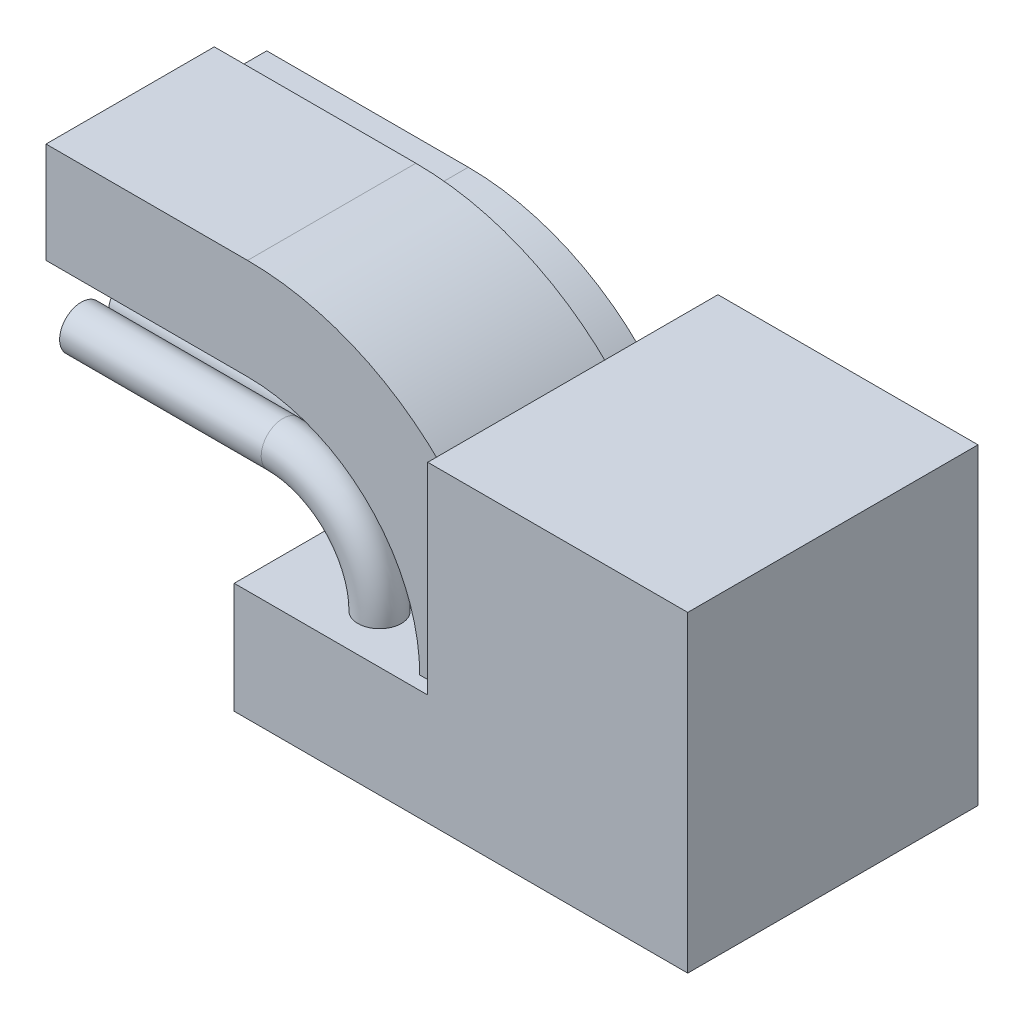
ISO-10303-21;
HEADER;
FILE_DESCRIPTION(('STEP AP214'),'2;1');
FILE_NAME('part.step','',(''),(''),'','','');
FILE_SCHEMA(('AUTOMOTIVE_DESIGN { 1 0 10303 214 1 1 1 1 }'));
ENDSEC;
DATA;
#1=APPLICATION_CONTEXT('core data for automotive mechanical design processes');
#2=APPLICATION_PROTOCOL_DEFINITION('international standard','automotive_design',2000,#1);
#3=PRODUCT_CONTEXT('',#1,'mechanical');
#4=PRODUCT('Part','Part','',(#3));
#5=PRODUCT_RELATED_PRODUCT_CATEGORY('part','',(#4));
#6=PRODUCT_DEFINITION_FORMATION('','',#4);
#7=PRODUCT_DEFINITION_CONTEXT('part definition',#1,'design');
#8=PRODUCT_DEFINITION('design','',#6,#7);
#9=PRODUCT_DEFINITION_SHAPE('','',#8);
#10=(LENGTH_UNIT() NAMED_UNIT(*) SI_UNIT(.MILLI.,.METRE.));
#11=(NAMED_UNIT(*) PLANE_ANGLE_UNIT() SI_UNIT($,.RADIAN.));
#12=(NAMED_UNIT(*) SI_UNIT($,.STERADIAN.) SOLID_ANGLE_UNIT());
#13=UNCERTAINTY_MEASURE_WITH_UNIT(LENGTH_MEASURE(1.E-05),#10,'distance_accuracy_value','');
#14=(GEOMETRIC_REPRESENTATION_CONTEXT(3) GLOBAL_UNCERTAINTY_ASSIGNED_CONTEXT((#13)) GLOBAL_UNIT_ASSIGNED_CONTEXT((#10,
#11,#12)) REPRESENTATION_CONTEXT('',''));
#15=CARTESIAN_POINT('',(0.,0.,0.));
#16=DIRECTION('',(0.,0.,1.));
#17=DIRECTION('',(1.,0.,0.));
#18=AXIS2_PLACEMENT_3D('',#15,#16,#17);
#19=CARTESIAN_POINT('',(0.,13.97,0.));
#20=DIRECTION('',(0.,-1.,0.));
#21=DIRECTION('',(0.,0.,-1.));
#22=AXIS2_PLACEMENT_3D('',#19,#20,#21);
#23=PLANE('',#22);
#24=CARTESIAN_POINT('',(-16.383,13.97,12.1570138463607));
#25=DIRECTION('',(0.,-1.,0.));
#26=DIRECTION('',(0.,0.,-1.));
#27=AXIS2_PLACEMENT_3D('',#24,#25,#26);
#28=CIRCLE('',#27,2.7305);
#29=CARTESIAN_POINT('',(-13.6525,13.97,12.1570138463607));
#30=VERTEX_POINT('',#29);
#31=EDGE_CURVE('E265',#30,#30,#28,.F.);
#32=ORIENTED_EDGE('',*,*,#31,.F.);
#33=EDGE_LOOP('',(#32));
#34=FACE_BOUND('',#33,.T.);
#35=CARTESIAN_POINT('',(-16.383,13.97,0.));
#36=DIRECTION('',(0.,-1.,0.));
#37=DIRECTION('',(0.,0.,-1.));
#38=AXIS2_PLACEMENT_3D('',#35,#36,#37);
#39=CIRCLE('',#38,2.7305);
#40=CARTESIAN_POINT('',(-13.6525,13.97,0.));
#41=VERTEX_POINT('',#40);
#42=EDGE_CURVE('E341',#41,#41,#39,.F.);
#43=ORIENTED_EDGE('',*,*,#42,.F.);
#44=EDGE_LOOP('',(#43));
#45=FACE_BOUND('',#44,.T.);
#46=CARTESIAN_POINT('',(-16.383,13.97,5.99911457720026));
#47=DIRECTION('',(0.,-1.,0.));
#48=DIRECTION('',(0.,0.,-1.));
#49=AXIS2_PLACEMENT_3D('',#46,#47,#48);
#50=CIRCLE('',#49,2.7305);
#51=CARTESIAN_POINT('',(-13.6525,13.97,5.99911457720026));
#52=VERTEX_POINT('',#51);
#53=EDGE_CURVE('E343',#52,#52,#50,.F.);
#54=ORIENTED_EDGE('',*,*,#53,.F.);
#55=EDGE_LOOP('',(#54));
#56=FACE_BOUND('',#55,.T.);
#57=DIRECTION('',(-1.,0.,0.));
#58=VECTOR('',#57,1.);
#59=CARTESIAN_POINT('',(-0.965296126701103,13.97,-4.60538542279974));
#60=LINE('',#59,#58);
#61=CARTESIAN_POINT('',(-4.19100000000001,13.97,-4.60538542279974));
#62=VERTEX_POINT('',#61);
#63=CARTESIAN_POINT('',(-6.880808194893,13.97,-4.60538542279974));
#64=VERTEX_POINT('',#63);
#65=EDGE_CURVE('E190',#62,#64,#60,.T.);
#66=ORIENTED_EDGE('',*,*,#65,.F.);
#67=DIRECTION('',(0.,0.,1.));
#68=VECTOR('',#67,1.);
#69=CARTESIAN_POINT('',(-4.19100000000001,13.97,-18.288));
#70=LINE('',#69,#68);
#71=CARTESIAN_POINT('',(-4.19100000000001,13.97,-18.288));
#72=VERTEX_POINT('',#71);
#73=EDGE_CURVE('E246',#72,#62,#70,.T.);
#74=ORIENTED_EDGE('',*,*,#73,.F.);
#75=DIRECTION('',(-1.,0.,0.));
#76=VECTOR('',#75,1.);
#77=CARTESIAN_POINT('',(-28.575,13.97,-18.288));
#78=LINE('',#77,#76);
#79=CARTESIAN_POINT('',(-28.575,13.97,-18.288));
#80=VERTEX_POINT('',#79);
#81=EDGE_CURVE('E411',#72,#80,#78,.T.);
#82=ORIENTED_EDGE('',*,*,#81,.T.);
#83=DIRECTION('',(0.,0.,1.));
#84=VECTOR('',#83,1.);
#85=CARTESIAN_POINT('',(-28.575,13.97,18.288));
#86=LINE('',#85,#84);
#87=CARTESIAN_POINT('',(-28.575,13.97,18.288));
#88=VERTEX_POINT('',#87);
#89=EDGE_CURVE('E324',#80,#88,#86,.T.);
#90=ORIENTED_EDGE('',*,*,#89,.T.);
#91=DIRECTION('',(1.,0.,0.));
#92=VECTOR('',#91,1.);
#93=CARTESIAN_POINT('',(-28.575,13.97,18.288));
#94=LINE('',#93,#92);
#95=CARTESIAN_POINT('',(-4.19100000000001,13.97,18.288));
#96=VERTEX_POINT('',#95);
#97=EDGE_CURVE('E321',#88,#96,#94,.T.);
#98=ORIENTED_EDGE('',*,*,#97,.T.);
#99=CARTESIAN_POINT('',(-4.19100000000001,13.97,16.6036145772003));
#100=VERTEX_POINT('',#99);
#101=EDGE_CURVE('E241',#100,#96,#70,.T.);
#102=ORIENTED_EDGE('',*,*,#101,.F.);
#103=DIRECTION('',(1.,0.,0.));
#104=VECTOR('',#103,1.);
#105=CARTESIAN_POINT('',(5.81919180510699,13.97,16.6036145772003));
#106=LINE('',#105,#104);
#107=CARTESIAN_POINT('',(-6.880808194893,13.97,16.6036145772003));
#108=VERTEX_POINT('',#107);
#109=EDGE_CURVE('E53',#108,#100,#106,.T.);
#110=ORIENTED_EDGE('',*,*,#109,.F.);
#111=DIRECTION('',(0.,0.,1.));
#112=VECTOR('',#111,1.);
#113=CARTESIAN_POINT('',(-6.88080819489301,13.97,16.6036145772003));
#114=LINE('',#113,#112);
#115=EDGE_CURVE('E48',#64,#108,#114,.T.);
#116=ORIENTED_EDGE('',*,*,#115,.F.);
#117=EDGE_LOOP('',(#66,#74,#82,#90,#98,#102,#110,#116));
#118=FACE_BOUND('',#117,.T.);
#119=ADVANCED_FACE('F33',(#34,#45,#56,#118),#23,.F.);
#120=CARTESIAN_POINT('',(-4.19100000000001,39.37,-18.288));
#121=DIRECTION('',(1.,0.,0.));
#122=DIRECTION('',(0.,0.,-1.));
#123=AXIS2_PLACEMENT_3D('',#120,#121,#122);
#124=PLANE('',#123);
#125=DIRECTION('',(0.,-1.,0.));
#126=VECTOR('',#125,1.);
#127=CARTESIAN_POINT('',(-4.19100000000001,39.37,-4.60538542279974));
#128=LINE('',#127,#126);
#129=CARTESIAN_POINT('',(-4.19100000000001,26.9205324975947,-4.60538542279974));
#130=VERTEX_POINT('',#129);
#131=EDGE_CURVE('E11',#130,#62,#128,.T.);
#132=ORIENTED_EDGE('',*,*,#131,.F.);
#133=DIRECTION('',(0.,0.,-1.));
#134=VECTOR('',#133,1.);
#135=CARTESIAN_POINT('',(-4.19100000000001,26.9205324975947,18.288));
#136=LINE('',#135,#134);
#137=CARTESIAN_POINT('',(-4.19100000000001,26.9205324975947,-11.2093854227997));
#138=VERTEX_POINT('',#137);
#139=EDGE_CURVE('E41',#138,#130,#136,.F.);
#140=ORIENTED_EDGE('',*,*,#139,.F.);
#141=DIRECTION('',(0.,-1.,0.));
#142=VECTOR('',#141,1.);
#143=CARTESIAN_POINT('',(-4.19100000000001,39.37,-11.2093854227997));
#144=LINE('',#143,#142);
#145=CARTESIAN_POINT('',(-4.19100000000001,32.5526626397534,-11.2093854227997));
#146=VERTEX_POINT('',#145);
#147=EDGE_CURVE('E279',#146,#138,#144,.T.);
#148=ORIENTED_EDGE('',*,*,#147,.F.);
#149=DIRECTION('',(0.,0.,-1.));
#150=VECTOR('',#149,1.);
#151=CARTESIAN_POINT('',(-4.19100000000001,32.5526626397534,18.288));
#152=LINE('',#151,#150);
#153=CARTESIAN_POINT('',(-4.19100000000001,32.5526626397534,-4.60538542279974));
#154=VERTEX_POINT('',#153);
#155=EDGE_CURVE('E276',#154,#146,#152,.T.);
#156=ORIENTED_EDGE('',*,*,#155,.F.);
#157=DIRECTION('',(0.,-1.,0.));
#158=VECTOR('',#157,1.);
#159=CARTESIAN_POINT('',(-4.19100000000001,39.37,-4.60538542279974));
#160=LINE('',#159,#158);
#161=CARTESIAN_POINT('',(-4.19100000000001,38.2265655839092,-4.60538542279974));
#162=VERTEX_POINT('',#161);
#163=EDGE_CURVE('E273',#162,#154,#160,.T.);
#164=ORIENTED_EDGE('',*,*,#163,.F.);
#165=DIRECTION('',(0.,0.,-1.));
#166=VECTOR('',#165,1.);
#167=CARTESIAN_POINT('',(-4.19100000000001,38.2265655839092,18.288));
#168=LINE('',#167,#166);
#169=CARTESIAN_POINT('',(-4.19100000000001,38.2265655839092,16.6036145772003));
#170=VERTEX_POINT('',#169);
#171=EDGE_CURVE('E270',#170,#162,#168,.T.);
#172=ORIENTED_EDGE('',*,*,#171,.F.);
#173=DIRECTION('',(0.,1.,0.));
#174=VECTOR('',#173,1.);
#175=CARTESIAN_POINT('',(-4.19100000000001,39.37,16.6036145772003));
#176=LINE('',#175,#174);
#177=EDGE_CURVE('E267',#100,#170,#176,.T.);
#178=ORIENTED_EDGE('',*,*,#177,.F.);
#179=ORIENTED_EDGE('',*,*,#101,.T.);
#180=DIRECTION('',(0.,-1.,0.));
#181=VECTOR('',#180,1.);
#182=CARTESIAN_POINT('',(-4.19100000000001,39.37,18.288));
#183=LINE('',#182,#181);
#184=CARTESIAN_POINT('',(-4.19100000000001,39.37,18.288));
#185=VERTEX_POINT('',#184);
#186=EDGE_CURVE('E253',#185,#96,#183,.T.);
#187=ORIENTED_EDGE('',*,*,#186,.F.);
#188=DIRECTION('',(0.,0.,1.));
#189=VECTOR('',#188,1.);
#190=CARTESIAN_POINT('',(-4.19100000000001,39.37,-18.288));
#191=LINE('',#190,#189);
#192=CARTESIAN_POINT('',(-4.19100000000001,39.37,-18.288));
#193=VERTEX_POINT('',#192);
#194=EDGE_CURVE('E248',#193,#185,#191,.T.);
#195=ORIENTED_EDGE('',*,*,#194,.F.);
#196=DIRECTION('',(0.,-1.,0.));
#197=VECTOR('',#196,1.);
#198=CARTESIAN_POINT('',(-4.19100000000001,39.37,-18.288));
#199=LINE('',#198,#197);
#200=EDGE_CURVE('E332',#193,#72,#199,.T.);
#201=ORIENTED_EDGE('',*,*,#200,.T.);
#202=ORIENTED_EDGE('',*,*,#73,.T.);
#203=EDGE_LOOP('',(#132,#140,#148,#156,#164,#172,#178,#179,#187,#195,#201,#202));
#204=FACE_BOUND('',#203,.T.);
#205=ADVANCED_FACE('F317',(#204),#124,.F.);
#206=CARTESIAN_POINT('',(28.575,13.97,18.288));
#207=DIRECTION('',(-1.,0.,0.));
#208=DIRECTION('',(0.,0.,1.));
#209=AXIS2_PLACEMENT_3D('',#206,#207,#208);
#210=PLANE('',#209);
#211=DIRECTION('',(0.,0.,-1.));
#212=VECTOR('',#211,1.);
#213=CARTESIAN_POINT('',(28.575,0.,18.288));
#214=LINE('',#213,#212);
#215=CARTESIAN_POINT('',(28.575,0.,18.288));
#216=VERTEX_POINT('',#215);
#217=CARTESIAN_POINT('',(28.575,0.,-18.288));
#218=VERTEX_POINT('',#217);
#219=EDGE_CURVE('E334',#216,#218,#214,.T.);
#220=ORIENTED_EDGE('',*,*,#219,.T.);
#221=DIRECTION('',(0.,-1.,0.));
#222=VECTOR('',#221,1.);
#223=CARTESIAN_POINT('',(28.575,13.97,-18.288));
#224=LINE('',#223,#222);
#225=CARTESIAN_POINT('',(28.575,39.37,-18.288));
#226=VERTEX_POINT('',#225);
#227=EDGE_CURVE('E344',#226,#218,#224,.T.);
#228=ORIENTED_EDGE('',*,*,#227,.F.);
#229=DIRECTION('',(0.,0.,-1.));
#230=VECTOR('',#229,1.);
#231=CARTESIAN_POINT('',(28.575,39.37,-18.288));
#232=LINE('',#231,#230);
#233=CARTESIAN_POINT('',(28.575,39.37,18.288));
#234=VERTEX_POINT('',#233);
#235=EDGE_CURVE('E242',#234,#226,#232,.T.);
#236=ORIENTED_EDGE('',*,*,#235,.F.);
#237=DIRECTION('',(0.,-1.,0.));
#238=VECTOR('',#237,1.);
#239=CARTESIAN_POINT('',(28.575,13.97,18.288));
#240=LINE('',#239,#238);
#241=EDGE_CURVE('E328',#234,#216,#240,.T.);
#242=ORIENTED_EDGE('',*,*,#241,.T.);
#243=EDGE_LOOP('',(#220,#228,#236,#242));
#244=FACE_BOUND('',#243,.T.);
#245=ADVANCED_FACE('F35',(#244),#210,.F.);
#246=CARTESIAN_POINT('',(-28.575,13.97,-18.288));
#247=DIRECTION('',(0.,0.,1.));
#248=DIRECTION('',(1.,0.,0.));
#249=AXIS2_PLACEMENT_3D('',#246,#247,#248);
#250=PLANE('',#249);
#251=DIRECTION('',(-1.,0.,0.));
#252=VECTOR('',#251,1.);
#253=CARTESIAN_POINT('',(-28.575,0.,-18.288));
#254=LINE('',#253,#252);
#255=CARTESIAN_POINT('',(-28.575,0.,-18.288));
#256=VERTEX_POINT('',#255);
#257=EDGE_CURVE('E396',#218,#256,#254,.T.);
#258=ORIENTED_EDGE('',*,*,#257,.T.);
#259=DIRECTION('',(0.,-1.,0.));
#260=VECTOR('',#259,1.);
#261=CARTESIAN_POINT('',(-28.575,13.97,-18.288));
#262=LINE('',#261,#260);
#263=EDGE_CURVE('E399',#80,#256,#262,.T.);
#264=ORIENTED_EDGE('',*,*,#263,.F.);
#265=ORIENTED_EDGE('',*,*,#81,.F.);
#266=ORIENTED_EDGE('',*,*,#200,.F.);
#267=DIRECTION('',(-1.,0.,0.));
#268=VECTOR('',#267,1.);
#269=CARTESIAN_POINT('',(28.575,39.37,-18.288));
#270=LINE('',#269,#268);
#271=EDGE_CURVE('E245',#226,#193,#270,.T.);
#272=ORIENTED_EDGE('',*,*,#271,.F.);
#273=ORIENTED_EDGE('',*,*,#227,.T.);
#274=EDGE_LOOP('',(#258,#264,#265,#266,#272,#273));
#275=FACE_BOUND('',#274,.T.);
#276=ADVANCED_FACE('F386',(#275),#250,.F.);
#277=CARTESIAN_POINT('',(-28.575,13.97,18.288));
#278=DIRECTION('',(1.,0.,0.));
#279=DIRECTION('',(0.,0.,-1.));
#280=AXIS2_PLACEMENT_3D('',#277,#278,#279);
#281=PLANE('',#280);
#282=DIRECTION('',(0.,0.,1.));
#283=VECTOR('',#282,1.);
#284=CARTESIAN_POINT('',(-28.575,0.,18.288));
#285=LINE('',#284,#283);
#286=CARTESIAN_POINT('',(-28.575,0.,18.288));
#287=VERTEX_POINT('',#286);
#288=EDGE_CURVE('E404',#256,#287,#285,.T.);
#289=ORIENTED_EDGE('',*,*,#288,.T.);
#290=DIRECTION('',(0.,-1.,0.));
#291=VECTOR('',#290,1.);
#292=CARTESIAN_POINT('',(-28.575,13.97,18.288));
#293=LINE('',#292,#291);
#294=EDGE_CURVE('E406',#88,#287,#293,.T.);
#295=ORIENTED_EDGE('',*,*,#294,.F.);
#296=ORIENTED_EDGE('',*,*,#89,.F.);
#297=ORIENTED_EDGE('',*,*,#263,.T.);
#298=EDGE_LOOP('',(#289,#295,#296,#297));
#299=FACE_BOUND('',#298,.T.);
#300=ADVANCED_FACE('F384',(#299),#281,.F.);
#301=CARTESIAN_POINT('',(-28.575,13.97,18.288));
#302=DIRECTION('',(0.,0.,-1.));
#303=DIRECTION('',(-1.,0.,0.));
#304=AXIS2_PLACEMENT_3D('',#301,#302,#303);
#305=PLANE('',#304);
#306=DIRECTION('',(1.,0.,0.));
#307=VECTOR('',#306,1.);
#308=CARTESIAN_POINT('',(-28.575,0.,18.288));
#309=LINE('',#308,#307);
#310=EDGE_CURVE('E409',#287,#216,#309,.T.);
#311=ORIENTED_EDGE('',*,*,#310,.T.);
#312=ORIENTED_EDGE('',*,*,#241,.F.);
#313=DIRECTION('',(1.,0.,0.));
#314=VECTOR('',#313,1.);
#315=CARTESIAN_POINT('',(28.575,39.37,18.288));
#316=LINE('',#315,#314);
#317=EDGE_CURVE('E250',#185,#234,#316,.T.);
#318=ORIENTED_EDGE('',*,*,#317,.F.);
#319=ORIENTED_EDGE('',*,*,#186,.T.);
#320=ORIENTED_EDGE('',*,*,#97,.F.);
#321=ORIENTED_EDGE('',*,*,#294,.T.);
#322=EDGE_LOOP('',(#311,#312,#318,#319,#320,#321));
#323=FACE_BOUND('',#322,.T.);
#324=ADVANCED_FACE('F330',(#323),#305,.F.);
#325=CARTESIAN_POINT('',(0.,0.,0.));
#326=DIRECTION('',(0.,-1.,0.));
#327=DIRECTION('',(0.,0.,-1.));
#328=AXIS2_PLACEMENT_3D('',#325,#326,#327);
#329=PLANE('',#328);
#330=ORIENTED_EDGE('',*,*,#219,.F.);
#331=ORIENTED_EDGE('',*,*,#310,.F.);
#332=ORIENTED_EDGE('',*,*,#288,.F.);
#333=ORIENTED_EDGE('',*,*,#257,.F.);
#334=EDGE_LOOP('',(#330,#331,#332,#333));
#335=FACE_BOUND('',#334,.T.);
#336=ADVANCED_FACE('F371',(#335),#329,.T.);
#337=CARTESIAN_POINT('',(0.,39.37,0.));
#338=DIRECTION('',(0.,-1.,0.));
#339=DIRECTION('',(0.,0.,-1.));
#340=AXIS2_PLACEMENT_3D('',#337,#338,#339);
#341=PLANE('',#340);
#342=ORIENTED_EDGE('',*,*,#235,.T.);
#343=ORIENTED_EDGE('',*,*,#271,.T.);
#344=ORIENTED_EDGE('',*,*,#194,.T.);
#345=ORIENTED_EDGE('',*,*,#317,.T.);
#346=EDGE_LOOP('',(#342,#343,#344,#345));
#347=FACE_BOUND('',#346,.T.);
#348=ADVANCED_FACE('F362',(#347),#341,.F.);
#349=CARTESIAN_POINT('',(-28.575,13.97,0.));
#350=DIRECTION('',(0.,0.,-1.));
#351=DIRECTION('',(-1.,0.,0.));
#352=AXIS2_PLACEMENT_3D('',#349,#350,#351);
#353=TOROIDAL_SURFACE('',#352,12.192,2.7305);
#354=CARTESIAN_POINT('',(-28.5750000000001,26.162,0.));
#355=DIRECTION('',(-1.,0.,0.));
#356=DIRECTION('',(0.,0.,1.));
#357=AXIS2_PLACEMENT_3D('',#354,#355,#356);
#358=CIRCLE('',#357,2.7305);
#359=CARTESIAN_POINT('',(-28.5750000000001,28.8925,0.));
#360=VERTEX_POINT('',#359);
#361=EDGE_CURVE('E238',#360,#360,#358,.T.);
#362=CARTESIAN_POINT('',(-28.575,13.97,0.));
#363=DIRECTION('',(0.,0.,-1.));
#364=DIRECTION('',(-1.,0.,0.));
#365=AXIS2_PLACEMENT_3D('',#362,#363,#364);
#366=CIRCLE('',#365,14.9225);
#367=EDGE_CURVE('',#360,#41,#366,.T.);
#368=ORIENTED_EDGE('',*,*,#361,.F.);
#369=ORIENTED_EDGE('',*,*,#42,.T.);
#370=ORIENTED_EDGE('',*,*,#367,.T.);
#371=ORIENTED_EDGE('',*,*,#367,.F.);
#372=EDGE_LOOP('',(#368,#370,#369,#371));
#373=FACE_BOUND('',#372,.T.);
#374=ADVANCED_FACE('F359',(#373),#353,.T.);
#375=CARTESIAN_POINT('',(-28.575,13.97,5.99911457720026));
#376=DIRECTION('',(0.,0.,-1.));
#377=DIRECTION('',(-1.,0.,0.));
#378=AXIS2_PLACEMENT_3D('',#375,#376,#377);
#379=TOROIDAL_SURFACE('',#378,12.192,2.7305);
#380=CARTESIAN_POINT('',(-28.5750000000001,26.162,5.99911457720026));
#381=DIRECTION('',(-1.,0.,0.));
#382=DIRECTION('',(0.,0.,1.));
#383=AXIS2_PLACEMENT_3D('',#380,#381,#382);
#384=CIRCLE('',#383,2.7305);
#385=CARTESIAN_POINT('',(-28.5750000000001,28.8925,5.99911457720026));
#386=VERTEX_POINT('',#385);
#387=EDGE_CURVE('E235',#386,#386,#384,.T.);
#388=CARTESIAN_POINT('',(-28.575,13.97,5.99911457720026));
#389=DIRECTION('',(0.,0.,-1.));
#390=DIRECTION('',(-1.,0.,0.));
#391=AXIS2_PLACEMENT_3D('',#388,#389,#390);
#392=CIRCLE('',#391,14.9225);
#393=EDGE_CURVE('',#386,#52,#392,.T.);
#394=ORIENTED_EDGE('',*,*,#387,.F.);
#395=ORIENTED_EDGE('',*,*,#53,.T.);
#396=ORIENTED_EDGE('',*,*,#393,.T.);
#397=ORIENTED_EDGE('',*,*,#393,.F.);
#398=EDGE_LOOP('',(#394,#396,#395,#397));
#399=FACE_BOUND('',#398,.T.);
#400=ADVANCED_FACE('F361',(#399),#379,.T.);
#401=CARTESIAN_POINT('',(-28.575,13.97,12.1570138463607));
#402=DIRECTION('',(0.,0.,-1.));
#403=DIRECTION('',(-1.,0.,0.));
#404=AXIS2_PLACEMENT_3D('',#401,#402,#403);
#405=TOROIDAL_SURFACE('',#404,12.192,2.7305);
#406=CARTESIAN_POINT('',(-28.5750000000001,26.162,12.1570138463607));
#407=DIRECTION('',(-1.,0.,0.));
#408=DIRECTION('',(0.,0.,1.));
#409=AXIS2_PLACEMENT_3D('',#406,#407,#408);
#410=CIRCLE('',#409,2.7305);
#411=CARTESIAN_POINT('',(-28.5750000000001,28.8925,12.1570138463607));
#412=VERTEX_POINT('',#411);
#413=EDGE_CURVE('E232',#412,#412,#410,.T.);
#414=CARTESIAN_POINT('',(-28.575,13.97,12.1570138463607));
#415=DIRECTION('',(0.,0.,-1.));
#416=DIRECTION('',(-1.,0.,0.));
#417=AXIS2_PLACEMENT_3D('',#414,#415,#416);
#418=CIRCLE('',#417,14.9225);
#419=EDGE_CURVE('',#412,#30,#418,.T.);
#420=ORIENTED_EDGE('',*,*,#413,.F.);
#421=ORIENTED_EDGE('',*,*,#31,.T.);
#422=ORIENTED_EDGE('',*,*,#419,.T.);
#423=ORIENTED_EDGE('',*,*,#419,.F.);
#424=EDGE_LOOP('',(#420,#422,#421,#423));
#425=FACE_BOUND('',#424,.T.);
#426=ADVANCED_FACE('F351',(#425),#405,.T.);
#427=CARTESIAN_POINT('',(-28.575,13.97,18.288));
#428=DIRECTION('',(0.,0.,-1.));
#429=DIRECTION('',(-1.,0.,0.));
#430=AXIS2_PLACEMENT_3D('',#427,#428,#429);
#431=CYLINDRICAL_SURFACE('',#430,34.394191805107);
#432=CARTESIAN_POINT('',(-28.575,13.97,16.6036145772003));
#433=DIRECTION('',(0.,0.,-1.));
#434=DIRECTION('',(-1.,0.,0.));
#435=AXIS2_PLACEMENT_3D('',#432,#433,#434);
#436=CIRCLE('',#435,34.394191805107);
#437=CARTESIAN_POINT('',(-28.5750000000001,48.364191805107,16.6036145772003));
#438=VERTEX_POINT('',#437);
#439=EDGE_CURVE('E209',#438,#170,#436,.T.);
#440=ORIENTED_EDGE('',*,*,#439,.T.);
#441=ORIENTED_EDGE('',*,*,#171,.T.);
#442=CARTESIAN_POINT('',(-28.575,13.97,-4.60538542279974));
#443=DIRECTION('',(0.,0.,-1.));
#444=DIRECTION('',(-1.,0.,0.));
#445=AXIS2_PLACEMENT_3D('',#442,#443,#444);
#446=CIRCLE('',#445,34.394191805107);
#447=CARTESIAN_POINT('',(-28.5750000000001,48.364191805107,-4.60538542279974));
#448=VERTEX_POINT('',#447);
#449=EDGE_CURVE('E229',#448,#162,#446,.T.);
#450=ORIENTED_EDGE('',*,*,#449,.F.);
#451=DIRECTION('',(0.,0.,-1.));
#452=VECTOR('',#451,1.);
#453=CARTESIAN_POINT('',(-28.5750000000001,48.364191805107,16.6036145772003));
#454=LINE('',#453,#452);
#455=EDGE_CURVE('E199',#438,#448,#454,.T.);
#456=ORIENTED_EDGE('',*,*,#455,.F.);
#457=EDGE_LOOP('',(#440,#441,#450,#456));
#458=FACE_BOUND('',#457,.T.);
#459=ADVANCED_FACE('F316',(#458),#431,.T.);
#460=CARTESIAN_POINT('',(-28.5750000000001,48.364191805107,-4.60538542279974));
#461=DIRECTION('',(0.,0.,1.));
#462=DIRECTION('',(1.,0.,0.));
#463=AXIS2_PLACEMENT_3D('',#460,#461,#462);
#464=PLANE('',#463);
#465=ORIENTED_EDGE('',*,*,#449,.T.);
#466=ORIENTED_EDGE('',*,*,#163,.T.);
#467=CARTESIAN_POINT('',(-28.575,13.97,-4.60538542279974));
#468=DIRECTION('',(0.,0.,-1.));
#469=DIRECTION('',(-1.,0.,0.));
#470=AXIS2_PLACEMENT_3D('',#467,#468,#469);
#471=CIRCLE('',#470,30.6577038732989);
#472=CARTESIAN_POINT('',(-28.5750000000001,44.6277038732989,-4.60538542279974));
#473=VERTEX_POINT('',#472);
#474=EDGE_CURVE('E226',#473,#154,#471,.T.);
#475=ORIENTED_EDGE('',*,*,#474,.F.);
#476=DIRECTION('',(1.,0.,0.));
#477=VECTOR('',#476,1.);
#478=CARTESIAN_POINT('',(-53.9750000000001,44.6277038732988,-4.60538542279974));
#479=LINE('',#478,#477);
#480=CARTESIAN_POINT('',(-53.9750000000001,44.6277038732988,-4.60538542279974));
#481=VERTEX_POINT('',#480);
#482=EDGE_CURVE('E304',#481,#473,#479,.T.);
#483=ORIENTED_EDGE('',*,*,#482,.F.);
#484=DIRECTION('',(0.,-1.,0.));
#485=VECTOR('',#484,1.);
#486=CARTESIAN_POINT('',(-53.9750000000001,44.6277038732988,-4.60538542279974));
#487=LINE('',#486,#485);
#488=CARTESIAN_POINT('',(-53.9750000000001,48.3641918051069,-4.60538542279974));
#489=VERTEX_POINT('',#488);
#490=EDGE_CURVE('E312',#489,#481,#487,.T.);
#491=ORIENTED_EDGE('',*,*,#490,.F.);
#492=DIRECTION('',(1.,0.,0.));
#493=VECTOR('',#492,1.);
#494=CARTESIAN_POINT('',(-53.9750000000001,48.3641918051069,-4.60538542279974));
#495=LINE('',#494,#493);
#496=EDGE_CURVE('E193',#489,#448,#495,.T.);
#497=ORIENTED_EDGE('',*,*,#496,.T.);
#498=EDGE_LOOP('',(#465,#466,#475,#483,#491,#497));
#499=FACE_BOUND('',#498,.T.);
#500=ADVANCED_FACE('F310',(#499),#464,.F.);
#501=CARTESIAN_POINT('',(-28.575,13.97,18.288));
#502=DIRECTION('',(0.,0.,-1.));
#503=DIRECTION('',(-1.,0.,0.));
#504=AXIS2_PLACEMENT_3D('',#501,#502,#503);
#505=CYLINDRICAL_SURFACE('',#504,30.6577038732989);
#506=ORIENTED_EDGE('',*,*,#474,.T.);
#507=ORIENTED_EDGE('',*,*,#155,.T.);
#508=CARTESIAN_POINT('',(-28.575,13.97,-11.2093854227997));
#509=DIRECTION('',(0.,0.,-1.));
#510=DIRECTION('',(-1.,0.,0.));
#511=AXIS2_PLACEMENT_3D('',#508,#509,#510);
#512=CIRCLE('',#511,30.6577038732989);
#513=CARTESIAN_POINT('',(-28.5750000000001,44.6277038732989,-11.2093854227997));
#514=VERTEX_POINT('',#513);
#515=EDGE_CURVE('E223',#514,#146,#512,.T.);
#516=ORIENTED_EDGE('',*,*,#515,.F.);
#517=DIRECTION('',(0.,0.,-1.));
#518=VECTOR('',#517,1.);
#519=CARTESIAN_POINT('',(-28.5750000000001,44.6277038732989,-4.60538542279974));
#520=LINE('',#519,#518);
#521=EDGE_CURVE('E202',#473,#514,#520,.T.);
#522=ORIENTED_EDGE('',*,*,#521,.F.);
#523=EDGE_LOOP('',(#506,#507,#516,#522));
#524=FACE_BOUND('',#523,.T.);
#525=ADVANCED_FACE('F443',(#524),#505,.T.);
#526=CARTESIAN_POINT('',(-28.5750000000001,44.6277038732989,-11.2093854227997));
#527=DIRECTION('',(0.,0.,1.));
#528=DIRECTION('',(1.,0.,0.));
#529=AXIS2_PLACEMENT_3D('',#526,#527,#528);
#530=PLANE('',#529);
#531=ORIENTED_EDGE('',*,*,#515,.T.);
#532=ORIENTED_EDGE('',*,*,#147,.T.);
#533=CARTESIAN_POINT('',(-28.575,13.97,-11.2093854227997));
#534=DIRECTION('',(0.,0.,-1.));
#535=DIRECTION('',(-1.,0.,0.));
#536=AXIS2_PLACEMENT_3D('',#533,#534,#535);
#537=CIRCLE('',#536,27.6097038732989);
#538=CARTESIAN_POINT('',(-28.5750000000001,41.5797038732989,-11.2093854227997));
#539=VERTEX_POINT('',#538);
#540=EDGE_CURVE('E220',#539,#138,#537,.T.);
#541=ORIENTED_EDGE('',*,*,#540,.F.);
#542=DIRECTION('',(1.,0.,0.));
#543=VECTOR('',#542,1.);
#544=CARTESIAN_POINT('',(-53.9750000000001,41.5797038732988,-11.2093854227997));
#545=LINE('',#544,#543);
#546=CARTESIAN_POINT('',(-53.9750000000001,41.5797038732988,-11.2093854227997));
#547=VERTEX_POINT('',#546);
#548=EDGE_CURVE('E293',#547,#539,#545,.T.);
#549=ORIENTED_EDGE('',*,*,#548,.F.);
#550=DIRECTION('',(0.,-1.,0.));
#551=VECTOR('',#550,1.);
#552=CARTESIAN_POINT('',(-53.9750000000001,44.6277038732988,-11.2093854227997));
#553=LINE('',#552,#551);
#554=CARTESIAN_POINT('',(-53.9750000000001,44.6277038732988,-11.2093854227997));
#555=VERTEX_POINT('',#554);
#556=EDGE_CURVE('E690',#555,#547,#553,.T.);
#557=ORIENTED_EDGE('',*,*,#556,.F.);
#558=DIRECTION('',(1.,0.,0.));
#559=VECTOR('',#558,1.);
#560=CARTESIAN_POINT('',(-53.9750000000001,44.6277038732988,-11.2093854227997));
#561=LINE('',#560,#559);
#562=EDGE_CURVE('E297',#555,#514,#561,.T.);
#563=ORIENTED_EDGE('',*,*,#562,.T.);
#564=EDGE_LOOP('',(#531,#532,#541,#549,#557,#563));
#565=FACE_BOUND('',#564,.T.);
#566=ADVANCED_FACE('F440',(#565),#530,.F.);
#567=CARTESIAN_POINT('',(-28.575,13.97,18.288));
#568=DIRECTION('',(0.,0.,-1.));
#569=DIRECTION('',(-1.,0.,0.));
#570=AXIS2_PLACEMENT_3D('',#567,#568,#569);
#571=CYLINDRICAL_SURFACE('',#570,27.6097038732989);
#572=ORIENTED_EDGE('',*,*,#540,.T.);
#573=ORIENTED_EDGE('',*,*,#139,.T.);
#574=CARTESIAN_POINT('',(-28.575,13.97,-4.60538542279974));
#575=DIRECTION('',(0.,0.,-1.));
#576=DIRECTION('',(-1.,0.,0.));
#577=AXIS2_PLACEMENT_3D('',#574,#575,#576);
#578=CIRCLE('',#577,27.6097038732989);
#579=CARTESIAN_POINT('',(-28.5750000000001,41.5797038732989,-4.60538542279974));
#580=VERTEX_POINT('',#579);
#581=EDGE_CURVE('E217',#580,#130,#578,.T.);
#582=ORIENTED_EDGE('',*,*,#581,.F.);
#583=DIRECTION('',(0.,0.,1.));
#584=VECTOR('',#583,1.);
#585=CARTESIAN_POINT('',(-28.5750000000001,41.5797038732989,-4.60538542279974));
#586=LINE('',#585,#584);
#587=EDGE_CURVE('E205',#539,#580,#586,.T.);
#588=ORIENTED_EDGE('',*,*,#587,.F.);
#589=EDGE_LOOP('',(#572,#573,#582,#588));
#590=FACE_BOUND('',#589,.T.);
#591=ADVANCED_FACE('F283',(#590),#571,.F.);
#592=CARTESIAN_POINT('',(-28.5750000000001,41.5797038732989,-4.60538542279974));
#593=DIRECTION('',(0.,0.,1.));
#594=DIRECTION('',(1.,0.,0.));
#595=AXIS2_PLACEMENT_3D('',#592,#593,#594);
#596=PLANE('',#595);
#597=ORIENTED_EDGE('',*,*,#581,.T.);
#598=ORIENTED_EDGE('',*,*,#131,.T.);
#599=ORIENTED_EDGE('',*,*,#65,.T.);
#600=CARTESIAN_POINT('',(-28.575,13.97,-4.60538542279974));
#601=DIRECTION('',(0.,0.,-1.));
#602=DIRECTION('',(-1.,0.,0.));
#603=AXIS2_PLACEMENT_3D('',#600,#601,#602);
#604=CIRCLE('',#603,21.694191805107);
#605=CARTESIAN_POINT('',(-28.5750000000001,35.664191805107,-4.60538542279974));
#606=VERTEX_POINT('',#605);
#607=EDGE_CURVE('E214',#606,#64,#604,.T.);
#608=ORIENTED_EDGE('',*,*,#607,.F.);
#609=DIRECTION('',(1.,0.,0.));
#610=VECTOR('',#609,1.);
#611=CARTESIAN_POINT('',(-53.9750000000001,35.6641918051069,-4.60538542279974));
#612=LINE('',#611,#610);
#613=CARTESIAN_POINT('',(-53.9750000000001,35.6641918051069,-4.60538542279974));
#614=VERTEX_POINT('',#613);
#615=EDGE_CURVE('E294',#614,#606,#612,.T.);
#616=ORIENTED_EDGE('',*,*,#615,.F.);
#617=DIRECTION('',(0.,-1.,0.));
#618=VECTOR('',#617,1.);
#619=CARTESIAN_POINT('',(-53.9750000000001,35.6641918051069,-4.60538542279974));
#620=LINE('',#619,#618);
#621=CARTESIAN_POINT('',(-53.9750000000001,41.5797038732988,-4.60538542279974));
#622=VERTEX_POINT('',#621);
#623=EDGE_CURVE('E181',#622,#614,#620,.T.);
#624=ORIENTED_EDGE('',*,*,#623,.F.);
#625=DIRECTION('',(1.,0.,0.));
#626=VECTOR('',#625,1.);
#627=CARTESIAN_POINT('',(-53.9750000000001,41.5797038732988,-4.60538542279974));
#628=LINE('',#627,#626);
#629=EDGE_CURVE('E290',#622,#580,#628,.T.);
#630=ORIENTED_EDGE('',*,*,#629,.T.);
#631=EDGE_LOOP('',(#597,#598,#599,#608,#616,#624,#630));
#632=FACE_BOUND('',#631,.T.);
#633=ADVANCED_FACE('F288',(#632),#596,.F.);
#634=CARTESIAN_POINT('',(-28.5750000000001,48.364191805107,16.6036145772003));
#635=DIRECTION('',(0.,0.,-1.));
#636=DIRECTION('',(-1.,0.,0.));
#637=AXIS2_PLACEMENT_3D('',#634,#635,#636);
#638=PLANE('',#637);
#639=ORIENTED_EDGE('',*,*,#109,.T.);
#640=ORIENTED_EDGE('',*,*,#177,.T.);
#641=ORIENTED_EDGE('',*,*,#439,.F.);
#642=DIRECTION('',(1.,0.,0.));
#643=VECTOR('',#642,1.);
#644=CARTESIAN_POINT('',(-53.9750000000001,48.3641918051069,16.6036145772003));
#645=LINE('',#644,#643);
#646=CARTESIAN_POINT('',(-53.9750000000001,48.3641918051069,16.6036145772003));
#647=VERTEX_POINT('',#646);
#648=EDGE_CURVE('E172',#647,#438,#645,.T.);
#649=ORIENTED_EDGE('',*,*,#648,.F.);
#650=DIRECTION('',(0.,1.,0.));
#651=VECTOR('',#650,1.);
#652=CARTESIAN_POINT('',(-53.9750000000001,35.6641918051069,16.6036145772003));
#653=LINE('',#652,#651);
#654=CARTESIAN_POINT('',(-53.9750000000001,35.6641918051069,16.6036145772003));
#655=VERTEX_POINT('',#654);
#656=EDGE_CURVE('E164',#655,#647,#653,.T.);
#657=ORIENTED_EDGE('',*,*,#656,.F.);
#658=DIRECTION('',(1.,0.,0.));
#659=VECTOR('',#658,1.);
#660=CARTESIAN_POINT('',(-53.9750000000001,35.6641918051069,16.6036145772003));
#661=LINE('',#660,#659);
#662=CARTESIAN_POINT('',(-28.5750000000001,35.664191805107,16.6036145772003));
#663=VERTEX_POINT('',#662);
#664=EDGE_CURVE('E168',#655,#663,#661,.T.);
#665=ORIENTED_EDGE('',*,*,#664,.T.);
#666=CARTESIAN_POINT('',(-28.575,13.97,16.6036145772003));
#667=DIRECTION('',(0.,0.,-1.));
#668=DIRECTION('',(-1.,0.,0.));
#669=AXIS2_PLACEMENT_3D('',#666,#667,#668);
#670=CIRCLE('',#669,21.694191805107);
#671=EDGE_CURVE('E212',#663,#108,#670,.T.);
#672=ORIENTED_EDGE('',*,*,#671,.T.);
#673=EDGE_LOOP('',(#639,#640,#641,#649,#657,#665,#672));
#674=FACE_BOUND('',#673,.T.);
#675=ADVANCED_FACE('F166',(#674),#638,.F.);
#676=CARTESIAN_POINT('',(-28.575,13.97,18.288));
#677=DIRECTION('',(0.,0.,-1.));
#678=DIRECTION('',(-1.,0.,0.));
#679=AXIS2_PLACEMENT_3D('',#676,#677,#678);
#680=CYLINDRICAL_SURFACE('',#679,21.694191805107);
#681=ORIENTED_EDGE('',*,*,#671,.F.);
#682=DIRECTION('',(0.,0.,1.));
#683=VECTOR('',#682,1.);
#684=CARTESIAN_POINT('',(-28.5750000000001,35.664191805107,16.6036145772003));
#685=LINE('',#684,#683);
#686=EDGE_CURVE('E189',#606,#663,#685,.T.);
#687=ORIENTED_EDGE('',*,*,#686,.F.);
#688=ORIENTED_EDGE('',*,*,#607,.T.);
#689=ORIENTED_EDGE('',*,*,#115,.T.);
#690=EDGE_LOOP('',(#681,#687,#688,#689));
#691=FACE_BOUND('',#690,.T.);
#692=ADVANCED_FACE('F425',(#691),#680,.F.);
#693=CARTESIAN_POINT('',(-53.9750000000001,35.6641918051069,-4.60538542279974));
#694=DIRECTION('',(0.,1.,0.));
#695=DIRECTION('',(-1.,0.,0.));
#696=AXIS2_PLACEMENT_3D('',#693,#694,#695);
#697=PLANE('',#696);
#698=ORIENTED_EDGE('',*,*,#686,.T.);
#699=ORIENTED_EDGE('',*,*,#664,.F.);
#700=DIRECTION('',(0.,0.,1.));
#701=VECTOR('',#700,1.);
#702=CARTESIAN_POINT('',(-53.9750000000001,35.6641918051069,-4.60538542279974));
#703=LINE('',#702,#701);
#704=EDGE_CURVE('E176',#614,#655,#703,.T.);
#705=ORIENTED_EDGE('',*,*,#704,.F.);
#706=ORIENTED_EDGE('',*,*,#615,.T.);
#707=EDGE_LOOP('',(#698,#699,#705,#706));
#708=FACE_BOUND('',#707,.T.);
#709=ADVANCED_FACE('F187',(#708),#697,.F.);
#710=CARTESIAN_POINT('',(-53.9750000000001,48.3641918051069,-4.60538542279974));
#711=DIRECTION('',(0.,-1.,0.));
#712=DIRECTION('',(1.,0.,0.));
#713=AXIS2_PLACEMENT_3D('',#710,#711,#712);
#714=PLANE('',#713);
#715=ORIENTED_EDGE('',*,*,#455,.T.);
#716=ORIENTED_EDGE('',*,*,#496,.F.);
#717=DIRECTION('',(0.,0.,-1.));
#718=VECTOR('',#717,1.);
#719=CARTESIAN_POINT('',(-53.9750000000001,48.3641918051069,-4.60538542279974));
#720=LINE('',#719,#718);
#721=EDGE_CURVE('E175',#647,#489,#720,.T.);
#722=ORIENTED_EDGE('',*,*,#721,.F.);
#723=ORIENTED_EDGE('',*,*,#648,.T.);
#724=EDGE_LOOP('',(#715,#716,#722,#723));
#725=FACE_BOUND('',#724,.T.);
#726=ADVANCED_FACE('F314',(#725),#714,.F.);
#727=CARTESIAN_POINT('',(-53.9750000000001,44.6277038732988,-11.2093854227997));
#728=DIRECTION('',(0.,-1.,0.));
#729=DIRECTION('',(1.,0.,0.));
#730=AXIS2_PLACEMENT_3D('',#727,#728,#729);
#731=PLANE('',#730);
#732=ORIENTED_EDGE('',*,*,#521,.T.);
#733=ORIENTED_EDGE('',*,*,#562,.F.);
#734=DIRECTION('',(0.,0.,-1.));
#735=VECTOR('',#734,1.);
#736=CARTESIAN_POINT('',(-53.9750000000001,44.6277038732988,-11.2093854227997));
#737=LINE('',#736,#735);
#738=EDGE_CURVE('E692',#481,#555,#737,.T.);
#739=ORIENTED_EDGE('',*,*,#738,.F.);
#740=ORIENTED_EDGE('',*,*,#482,.T.);
#741=EDGE_LOOP('',(#732,#733,#739,#740));
#742=FACE_BOUND('',#741,.T.);
#743=ADVANCED_FACE('F489',(#742),#731,.F.);
#744=CARTESIAN_POINT('',(-53.9750000000001,41.5797038732988,-11.2093854227997));
#745=DIRECTION('',(0.,1.,0.));
#746=DIRECTION('',(-1.,0.,0.));
#747=AXIS2_PLACEMENT_3D('',#744,#745,#746);
#748=PLANE('',#747);
#749=ORIENTED_EDGE('',*,*,#587,.T.);
#750=ORIENTED_EDGE('',*,*,#629,.F.);
#751=DIRECTION('',(0.,0.,1.));
#752=VECTOR('',#751,1.);
#753=CARTESIAN_POINT('',(-53.9750000000001,41.5797038732988,-11.2093854227997));
#754=LINE('',#753,#752);
#755=EDGE_CURVE('E691',#547,#622,#754,.T.);
#756=ORIENTED_EDGE('',*,*,#755,.F.);
#757=ORIENTED_EDGE('',*,*,#548,.T.);
#758=EDGE_LOOP('',(#749,#750,#756,#757));
#759=FACE_BOUND('',#758,.T.);
#760=ADVANCED_FACE('F486',(#759),#748,.F.);
#761=CARTESIAN_POINT('',(-53.975,-1.90164949351259E-13,0.));
#762=DIRECTION('',(-1.,0.,0.));
#763=DIRECTION('',(0.,-1.,0.));
#764=AXIS2_PLACEMENT_3D('',#761,#762,#763);
#765=PLANE('',#764);
#766=ORIENTED_EDGE('',*,*,#704,.T.);
#767=ORIENTED_EDGE('',*,*,#656,.T.);
#768=ORIENTED_EDGE('',*,*,#721,.T.);
#769=ORIENTED_EDGE('',*,*,#490,.T.);
#770=ORIENTED_EDGE('',*,*,#738,.T.);
#771=ORIENTED_EDGE('',*,*,#556,.T.);
#772=ORIENTED_EDGE('',*,*,#755,.T.);
#773=ORIENTED_EDGE('',*,*,#623,.T.);
#774=EDGE_LOOP('',(#766,#767,#768,#769,#770,#771,#772,#773));
#775=FACE_BOUND('',#774,.T.);
#776=ADVANCED_FACE('F179',(#775),#765,.T.);
#777=CARTESIAN_POINT('',(-53.9750000000001,26.1619999999999,0.));
#778=DIRECTION('',(1.,0.,0.));
#779=DIRECTION('',(0.,1.,0.));
#780=AXIS2_PLACEMENT_3D('',#777,#778,#779);
#781=CYLINDRICAL_SURFACE('',#780,2.7305);
#782=CARTESIAN_POINT('',(-53.9750000000001,26.1619999999999,0.));
#783=DIRECTION('',(-1.,0.,0.));
#784=DIRECTION('',(0.,-1.,0.));
#785=AXIS2_PLACEMENT_3D('',#782,#783,#784);
#786=CIRCLE('',#785,2.7305);
#787=CARTESIAN_POINT('',(-53.9750000000001,23.4314999999999,0.));
#788=VERTEX_POINT('',#787);
#789=EDGE_CURVE('E185',#788,#788,#786,.T.);
#790=ORIENTED_EDGE('',*,*,#789,.F.);
#791=EDGE_LOOP('',(#790));
#792=FACE_BOUND('',#791,.T.);
#793=ORIENTED_EDGE('',*,*,#361,.T.);
#794=EDGE_LOOP('',(#793));
#795=FACE_BOUND('',#794,.T.);
#796=ADVANCED_FACE('F479',(#792,#795),#781,.T.);
#797=CARTESIAN_POINT('',(-53.9750000000001,26.1619999999999,0.));
#798=DIRECTION('',(-1.,0.,0.));
#799=DIRECTION('',(0.,-1.,0.));
#800=AXIS2_PLACEMENT_3D('',#797,#798,#799);
#801=PLANE('',#800);
#802=ORIENTED_EDGE('',*,*,#789,.T.);
#803=EDGE_LOOP('',(#802));
#804=FACE_BOUND('',#803,.T.);
#805=ADVANCED_FACE('F475',(#804),#801,.T.);
#806=CARTESIAN_POINT('',(-53.9750000000001,26.1619999999999,5.99911457720026));
#807=DIRECTION('',(1.,0.,0.));
#808=DIRECTION('',(0.,1.,0.));
#809=AXIS2_PLACEMENT_3D('',#806,#807,#808);
#810=CYLINDRICAL_SURFACE('',#809,2.7305);
#811=CARTESIAN_POINT('',(-53.9750000000001,26.1619999999999,5.99911457720026));
#812=DIRECTION('',(-1.,0.,0.));
#813=DIRECTION('',(0.,-1.,0.));
#814=AXIS2_PLACEMENT_3D('',#811,#812,#813);
#815=CIRCLE('',#814,2.7305);
#816=CARTESIAN_POINT('',(-53.9750000000001,23.4314999999999,5.99911457720026));
#817=VERTEX_POINT('',#816);
#818=EDGE_CURVE('E701',#817,#817,#815,.T.);
#819=ORIENTED_EDGE('',*,*,#818,.F.);
#820=EDGE_LOOP('',(#819));
#821=FACE_BOUND('',#820,.T.);
#822=ORIENTED_EDGE('',*,*,#387,.T.);
#823=EDGE_LOOP('',(#822));
#824=FACE_BOUND('',#823,.T.);
#825=ADVANCED_FACE('F468',(#821,#824),#810,.T.);
#826=CARTESIAN_POINT('',(-53.9750000000001,26.1619999999999,5.99911457720026));
#827=DIRECTION('',(-1.,0.,0.));
#828=DIRECTION('',(0.,-1.,0.));
#829=AXIS2_PLACEMENT_3D('',#826,#827,#828);
#830=PLANE('',#829);
#831=ORIENTED_EDGE('',*,*,#818,.T.);
#832=EDGE_LOOP('',(#831));
#833=FACE_BOUND('',#832,.T.);
#834=ADVANCED_FACE('F459',(#833),#830,.T.);
#835=CARTESIAN_POINT('',(-53.9750000000001,26.1619999999999,12.1570138463607));
#836=DIRECTION('',(1.,0.,0.));
#837=DIRECTION('',(0.,1.,0.));
#838=AXIS2_PLACEMENT_3D('',#835,#836,#837);
#839=CYLINDRICAL_SURFACE('',#838,2.7305);
#840=CARTESIAN_POINT('',(-53.9750000000001,26.1619999999999,12.1570138463607));
#841=DIRECTION('',(-1.,0.,0.));
#842=DIRECTION('',(0.,-1.,0.));
#843=AXIS2_PLACEMENT_3D('',#840,#841,#842);
#844=CIRCLE('',#843,2.7305);
#845=CARTESIAN_POINT('',(-53.9750000000001,23.4314999999999,12.1570138463607));
#846=VERTEX_POINT('',#845);
#847=EDGE_CURVE('E704',#846,#846,#844,.T.);
#848=ORIENTED_EDGE('',*,*,#847,.F.);
#849=EDGE_LOOP('',(#848));
#850=FACE_BOUND('',#849,.T.);
#851=ORIENTED_EDGE('',*,*,#413,.T.);
#852=EDGE_LOOP('',(#851));
#853=FACE_BOUND('',#852,.T.);
#854=ADVANCED_FACE('F456',(#850,#853),#839,.T.);
#855=CARTESIAN_POINT('',(-53.9750000000001,26.1619999999999,12.1570138463607));
#856=DIRECTION('',(-1.,0.,0.));
#857=DIRECTION('',(0.,-1.,0.));
#858=AXIS2_PLACEMENT_3D('',#855,#856,#857);
#859=PLANE('',#858);
#860=ORIENTED_EDGE('',*,*,#847,.T.);
#861=EDGE_LOOP('',(#860));
#862=FACE_BOUND('',#861,.T.);
#863=ADVANCED_FACE('F458',(#862),#859,.T.);
#864=CLOSED_SHELL('',(#119,#205,#245,#276,#300,#324,#336,#348,#374,#400,#426,#459,#500,#525,
#566,#591,#633,#675,#692,#709,#726,#743,#760,#776,#796,#805,#825,#834,#854,#863));
#865=MANIFOLD_SOLID_BREP('B2',#864);
#866=ADVANCED_BREP_SHAPE_REPRESENTATION('',(#18,#865),#14);
#867=SHAPE_DEFINITION_REPRESENTATION(#9,#866);
ENDSEC;
END-ISO-10303-21;
